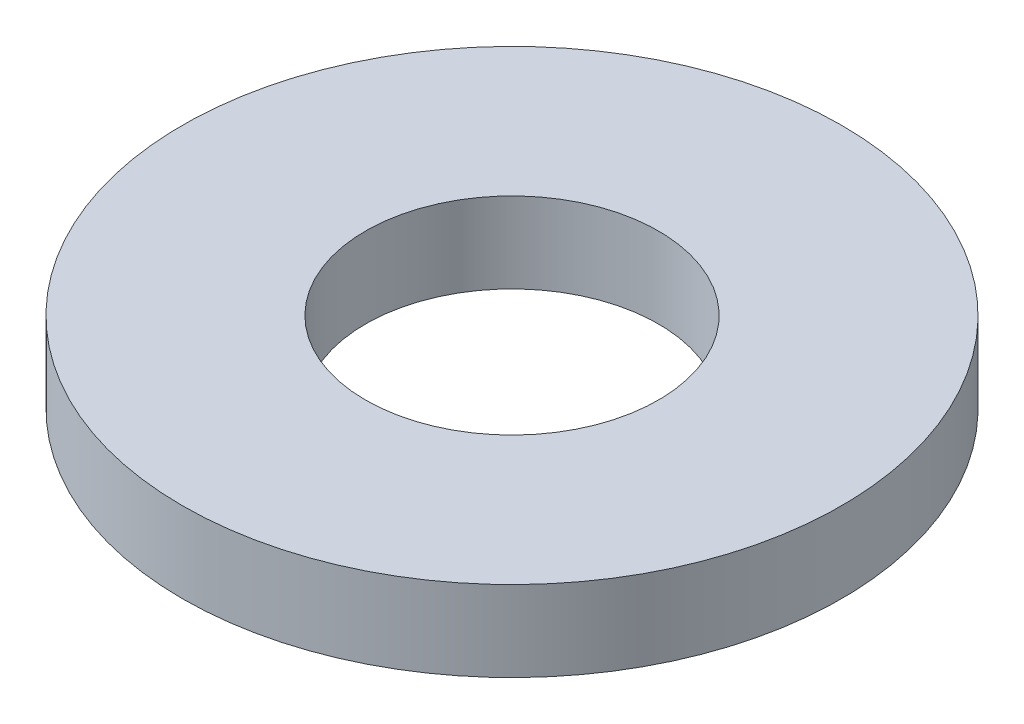
ISO-10303-21;
HEADER;
FILE_DESCRIPTION(('STEP AP214'),'2;1');
FILE_NAME('part.step','',(''),(''),'','','');
FILE_SCHEMA(('AUTOMOTIVE_DESIGN { 1 0 10303 214 1 1 1 1 }'));
ENDSEC;
DATA;
#1=APPLICATION_CONTEXT('core data for automotive mechanical design processes');
#2=APPLICATION_PROTOCOL_DEFINITION('international standard','automotive_design',2000,#1);
#3=PRODUCT_CONTEXT('',#1,'mechanical');
#4=PRODUCT('Part','Part','',(#3));
#5=PRODUCT_RELATED_PRODUCT_CATEGORY('part','',(#4));
#6=PRODUCT_DEFINITION_FORMATION('','',#4);
#7=PRODUCT_DEFINITION_CONTEXT('part definition',#1,'design');
#8=PRODUCT_DEFINITION('design','',#6,#7);
#9=PRODUCT_DEFINITION_SHAPE('','',#8);
#10=(LENGTH_UNIT() NAMED_UNIT(*) SI_UNIT(.MILLI.,.METRE.));
#11=(NAMED_UNIT(*) PLANE_ANGLE_UNIT() SI_UNIT($,.RADIAN.));
#12=(NAMED_UNIT(*) SI_UNIT($,.STERADIAN.) SOLID_ANGLE_UNIT());
#13=UNCERTAINTY_MEASURE_WITH_UNIT(LENGTH_MEASURE(1.E-05),#10,'distance_accuracy_value','');
#14=(GEOMETRIC_REPRESENTATION_CONTEXT(3) GLOBAL_UNCERTAINTY_ASSIGNED_CONTEXT((#13)) GLOBAL_UNIT_ASSIGNED_CONTEXT((#10,
#11,#12)) REPRESENTATION_CONTEXT('',''));
#15=CARTESIAN_POINT('',(0.,0.,0.));
#16=DIRECTION('',(0.,0.,1.));
#17=DIRECTION('',(1.,0.,0.));
#18=AXIS2_PLACEMENT_3D('',#15,#16,#17);
#19=CARTESIAN_POINT('',(0.,11.,0.));
#20=DIRECTION('',(0.,-1.,0.));
#21=DIRECTION('',(0.,0.,-1.));
#22=AXIS2_PLACEMENT_3D('',#19,#20,#21);
#23=CYLINDRICAL_SURFACE('',#22,45.);
#24=CARTESIAN_POINT('',(0.,11.,0.));
#25=DIRECTION('',(0.,1.,0.));
#26=DIRECTION('',(0.,0.,1.));
#27=AXIS2_PLACEMENT_3D('',#24,#25,#26);
#28=CIRCLE('',#27,45.);
#29=CARTESIAN_POINT('',(0.,11.,45.));
#30=VERTEX_POINT('',#29);
#31=EDGE_CURVE('E10',#30,#30,#28,.T.);
#32=ORIENTED_EDGE('',*,*,#31,.F.);
#33=EDGE_LOOP('',(#32));
#34=FACE_BOUND('',#33,.T.);
#35=CARTESIAN_POINT('',(0.,0.,0.));
#36=DIRECTION('',(0.,1.,0.));
#37=DIRECTION('',(0.,0.,1.));
#38=AXIS2_PLACEMENT_3D('',#35,#36,#37);
#39=CIRCLE('',#38,45.);
#40=CARTESIAN_POINT('',(0.,0.,45.));
#41=VERTEX_POINT('',#40);
#42=EDGE_CURVE('E37',#41,#41,#39,.T.);
#43=ORIENTED_EDGE('',*,*,#42,.T.);
#44=EDGE_LOOP('',(#43));
#45=FACE_BOUND('',#44,.T.);
#46=ADVANCED_FACE('F40',(#34,#45),#23,.T.);
#47=CARTESIAN_POINT('',(0.,11.,0.));
#48=DIRECTION('',(0.,1.,0.));
#49=DIRECTION('',(0.,0.,1.));
#50=AXIS2_PLACEMENT_3D('',#47,#48,#49);
#51=PLANE('',#50);
#52=CARTESIAN_POINT('',(0.,11.,0.));
#53=DIRECTION('',(0.,1.,0.));
#54=DIRECTION('',(0.,0.,1.));
#55=AXIS2_PLACEMENT_3D('',#52,#53,#54);
#56=CIRCLE('',#55,20.);
#57=CARTESIAN_POINT('',(0.,11.,20.));
#58=VERTEX_POINT('',#57);
#59=EDGE_CURVE('E50',#58,#58,#56,.T.);
#60=ORIENTED_EDGE('',*,*,#59,.F.);
#61=EDGE_LOOP('',(#60));
#62=FACE_BOUND('',#61,.T.);
#63=ORIENTED_EDGE('',*,*,#31,.T.);
#64=EDGE_LOOP('',(#63));
#65=FACE_BOUND('',#64,.T.);
#66=ADVANCED_FACE('F59',(#62,#65),#51,.T.);
#67=CARTESIAN_POINT('',(0.,0.,0.));
#68=DIRECTION('',(0.,1.,0.));
#69=DIRECTION('',(0.,0.,1.));
#70=AXIS2_PLACEMENT_3D('',#67,#68,#69);
#71=PLANE('',#70);
#72=CARTESIAN_POINT('',(0.,0.,0.));
#73=DIRECTION('',(0.,1.,0.));
#74=DIRECTION('',(0.,0.,1.));
#75=AXIS2_PLACEMENT_3D('',#72,#73,#74);
#76=CIRCLE('',#75,20.);
#77=CARTESIAN_POINT('',(0.,0.,20.));
#78=VERTEX_POINT('',#77);
#79=EDGE_CURVE('E47',#78,#78,#76,.T.);
#80=ORIENTED_EDGE('',*,*,#79,.T.);
#81=EDGE_LOOP('',(#80));
#82=FACE_BOUND('',#81,.T.);
#83=ORIENTED_EDGE('',*,*,#42,.F.);
#84=EDGE_LOOP('',(#83));
#85=FACE_BOUND('',#84,.T.);
#86=ADVANCED_FACE('F58',(#82,#85),#71,.F.);
#87=CARTESIAN_POINT('',(0.,11.,0.));
#88=DIRECTION('',(0.,-1.,0.));
#89=DIRECTION('',(0.,0.,-1.));
#90=AXIS2_PLACEMENT_3D('',#87,#88,#89);
#91=CYLINDRICAL_SURFACE('',#90,20.);
#92=ORIENTED_EDGE('',*,*,#59,.T.);
#93=EDGE_LOOP('',(#92));
#94=FACE_BOUND('',#93,.T.);
#95=ORIENTED_EDGE('',*,*,#79,.F.);
#96=EDGE_LOOP('',(#95));
#97=FACE_BOUND('',#96,.T.);
#98=ADVANCED_FACE('F54',(#94,#97),#91,.F.);
#99=CLOSED_SHELL('',(#46,#66,#86,#98));
#100=MANIFOLD_SOLID_BREP('B2',#99);
#101=ADVANCED_BREP_SHAPE_REPRESENTATION('',(#18,#100),#14);
#102=SHAPE_DEFINITION_REPRESENTATION(#9,#101);
ENDSEC;
END-ISO-10303-21;
